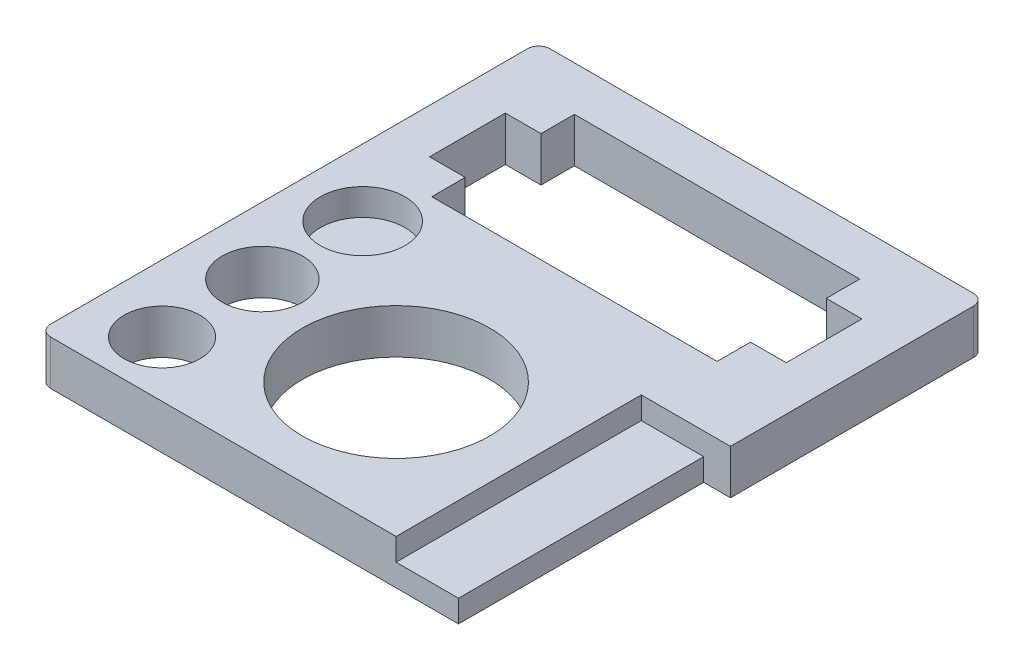
ISO-10303-21;
HEADER;
FILE_DESCRIPTION(('STEP AP214'),'2;1');
FILE_NAME('part.step','',(''),(''),'','','');
FILE_SCHEMA(('AUTOMOTIVE_DESIGN { 1 0 10303 214 1 1 1 1 }'));
ENDSEC;
DATA;
#1=APPLICATION_CONTEXT('core data for automotive mechanical design processes');
#2=APPLICATION_PROTOCOL_DEFINITION('international standard','automotive_design',2000,#1);
#3=PRODUCT_CONTEXT('',#1,'mechanical');
#4=PRODUCT('Part','Part','',(#3));
#5=PRODUCT_RELATED_PRODUCT_CATEGORY('part','',(#4));
#6=PRODUCT_DEFINITION_FORMATION('','',#4);
#7=PRODUCT_DEFINITION_CONTEXT('part definition',#1,'design');
#8=PRODUCT_DEFINITION('design','',#6,#7);
#9=PRODUCT_DEFINITION_SHAPE('','',#8);
#10=(LENGTH_UNIT() NAMED_UNIT(*) SI_UNIT(.MILLI.,.METRE.));
#11=(NAMED_UNIT(*) PLANE_ANGLE_UNIT() SI_UNIT($,.RADIAN.));
#12=(NAMED_UNIT(*) SI_UNIT($,.STERADIAN.) SOLID_ANGLE_UNIT());
#13=UNCERTAINTY_MEASURE_WITH_UNIT(LENGTH_MEASURE(1.E-05),#10,'distance_accuracy_value','');
#14=(GEOMETRIC_REPRESENTATION_CONTEXT(3) GLOBAL_UNCERTAINTY_ASSIGNED_CONTEXT((#13)) GLOBAL_UNIT_ASSIGNED_CONTEXT((#10,
#11,#12)) REPRESENTATION_CONTEXT('',''));
#15=CARTESIAN_POINT('',(0.,0.,0.));
#16=DIRECTION('',(0.,0.,1.));
#17=DIRECTION('',(1.,0.,0.));
#18=AXIS2_PLACEMENT_3D('',#15,#16,#17);
#19=CARTESIAN_POINT('',(0.,2.,6.));
#20=DIRECTION('',(0.,0.,-1.));
#21=DIRECTION('',(-1.,0.,0.));
#22=AXIS2_PLACEMENT_3D('',#19,#20,#21);
#23=PLANE('',#22);
#24=DIRECTION('',(1.,0.,0.));
#25=VECTOR('',#24,1.);
#26=CARTESIAN_POINT('',(0.,2.,6.));
#27=LINE('',#26,#25);
#28=CARTESIAN_POINT('',(-9.5,2.,6.));
#29=VERTEX_POINT('',#28);
#30=CARTESIAN_POINT('',(6.,2.,6.));
#31=VERTEX_POINT('',#30);
#32=EDGE_CURVE('E351',#29,#31,#27,.T.);
#33=ORIENTED_EDGE('',*,*,#32,.F.);
#34=DIRECTION('',(0.,-1.,0.));
#35=VECTOR('',#34,1.);
#36=CARTESIAN_POINT('',(-9.5,2.,6.));
#37=LINE('',#36,#35);
#38=CARTESIAN_POINT('',(-9.5,0.,6.));
#39=VERTEX_POINT('',#38);
#40=EDGE_CURVE('E273',#29,#39,#37,.T.);
#41=ORIENTED_EDGE('',*,*,#40,.T.);
#42=DIRECTION('',(1.,0.,0.));
#43=VECTOR('',#42,1.);
#44=CARTESIAN_POINT('',(0.,0.,6.));
#45=LINE('',#44,#43);
#46=CARTESIAN_POINT('',(8.8,0.,6.));
#47=VERTEX_POINT('',#46);
#48=EDGE_CURVE('E298',#39,#47,#45,.T.);
#49=ORIENTED_EDGE('',*,*,#48,.T.);
#50=DIRECTION('',(0.,-1.,0.));
#51=VECTOR('',#50,1.);
#52=CARTESIAN_POINT('',(8.8,1.,6.));
#53=LINE('',#52,#51);
#54=CARTESIAN_POINT('',(8.8,1.,6.));
#55=VERTEX_POINT('',#54);
#56=EDGE_CURVE('E391',#55,#47,#53,.T.);
#57=ORIENTED_EDGE('',*,*,#56,.F.);
#58=DIRECTION('',(-1.,0.,0.));
#59=VECTOR('',#58,1.);
#60=CARTESIAN_POINT('',(6.,1.,6.));
#61=LINE('',#60,#59);
#62=CARTESIAN_POINT('',(6.,1.,6.));
#63=VERTEX_POINT('',#62);
#64=EDGE_CURVE('E396',#55,#63,#61,.T.);
#65=ORIENTED_EDGE('',*,*,#64,.T.);
#66=DIRECTION('',(0.,-1.,0.));
#67=VECTOR('',#66,1.);
#68=CARTESIAN_POINT('',(6.,2.,6.));
#69=LINE('',#68,#67);
#70=EDGE_CURVE('E213',#31,#63,#69,.T.);
#71=ORIENTED_EDGE('',*,*,#70,.F.);
#72=EDGE_LOOP('',(#33,#41,#49,#57,#65,#71));
#73=FACE_BOUND('',#72,.T.);
#74=ADVANCED_FACE('F38',(#73),#23,.F.);
#75=CARTESIAN_POINT('',(6.,2.,0.));
#76=DIRECTION('',(-1.,0.,0.));
#77=DIRECTION('',(0.,0.,1.));
#78=AXIS2_PLACEMENT_3D('',#75,#76,#77);
#79=PLANE('',#78);
#80=ORIENTED_EDGE('',*,*,#70,.T.);
#81=DIRECTION('',(0.,0.,-1.));
#82=VECTOR('',#81,1.);
#83=CARTESIAN_POINT('',(6.,1.,-5.));
#84=LINE('',#83,#82);
#85=CARTESIAN_POINT('',(6.,1.,-5.));
#86=VERTEX_POINT('',#85);
#87=EDGE_CURVE('E197',#63,#86,#84,.T.);
#88=ORIENTED_EDGE('',*,*,#87,.T.);
#89=DIRECTION('',(0.,-1.,0.));
#90=VECTOR('',#89,1.);
#91=CARTESIAN_POINT('',(6.,2.,-5.));
#92=LINE('',#91,#90);
#93=CARTESIAN_POINT('',(6.,2.,-5.));
#94=VERTEX_POINT('',#93);
#95=EDGE_CURVE('E210',#94,#86,#92,.T.);
#96=ORIENTED_EDGE('',*,*,#95,.F.);
#97=DIRECTION('',(0.,0.,-1.));
#98=VECTOR('',#97,1.);
#99=CARTESIAN_POINT('',(6.,2.,0.));
#100=LINE('',#99,#98);
#101=EDGE_CURVE('E349',#31,#94,#100,.T.);
#102=ORIENTED_EDGE('',*,*,#101,.F.);
#103=EDGE_LOOP('',(#80,#88,#96,#102));
#104=FACE_BOUND('',#103,.T.);
#105=ADVANCED_FACE('F208',(#104),#79,.F.);
#106=CARTESIAN_POINT('',(0.,2.,-5.));
#107=DIRECTION('',(0.,0.,1.));
#108=DIRECTION('',(1.,0.,0.));
#109=AXIS2_PLACEMENT_3D('',#106,#107,#108);
#110=PLANE('',#109);
#111=DIRECTION('',(0.,-1.,0.));
#112=VECTOR('',#111,1.);
#113=CARTESIAN_POINT('',(8.8,1.,-5.));
#114=LINE('',#113,#112);
#115=CARTESIAN_POINT('',(8.8,1.,-5.));
#116=VERTEX_POINT('',#115);
#117=CARTESIAN_POINT('',(8.8,0.,-5.));
#118=VERTEX_POINT('',#117);
#119=EDGE_CURVE('E394',#116,#118,#114,.T.);
#120=ORIENTED_EDGE('',*,*,#119,.T.);
#121=DIRECTION('',(-1.,0.,0.));
#122=VECTOR('',#121,1.);
#123=CARTESIAN_POINT('',(0.,0.,-5.));
#124=LINE('',#123,#122);
#125=CARTESIAN_POINT('',(10.,0.,-5.));
#126=VERTEX_POINT('',#125);
#127=EDGE_CURVE('E295',#126,#118,#124,.T.);
#128=ORIENTED_EDGE('',*,*,#127,.F.);
#129=DIRECTION('',(0.,-1.,0.));
#130=VECTOR('',#129,1.);
#131=CARTESIAN_POINT('',(10.,2.,-5.));
#132=LINE('',#131,#130);
#133=CARTESIAN_POINT('',(10.,2.,-5.));
#134=VERTEX_POINT('',#133);
#135=EDGE_CURVE('E220',#134,#126,#132,.T.);
#136=ORIENTED_EDGE('',*,*,#135,.F.);
#137=DIRECTION('',(-1.,0.,0.));
#138=VECTOR('',#137,1.);
#139=CARTESIAN_POINT('',(0.,2.,-5.));
#140=LINE('',#139,#138);
#141=EDGE_CURVE('E219',#134,#94,#140,.T.);
#142=ORIENTED_EDGE('',*,*,#141,.T.);
#143=ORIENTED_EDGE('',*,*,#95,.T.);
#144=DIRECTION('',(1.,0.,0.));
#145=VECTOR('',#144,1.);
#146=CARTESIAN_POINT('',(6.,1.,-5.));
#147=LINE('',#146,#145);
#148=EDGE_CURVE('E193',#86,#116,#147,.T.);
#149=ORIENTED_EDGE('',*,*,#148,.T.);
#150=EDGE_LOOP('',(#120,#128,#136,#142,#143,#149));
#151=FACE_BOUND('',#150,.T.);
#152=ADVANCED_FACE('F216',(#151),#110,.T.);
#153=CARTESIAN_POINT('',(10.,2.,0.));
#154=DIRECTION('',(1.,0.,0.));
#155=DIRECTION('',(0.,0.,-1.));
#156=AXIS2_PLACEMENT_3D('',#153,#154,#155);
#157=PLANE('',#156);
#158=DIRECTION('',(0.,0.,1.));
#159=VECTOR('',#158,1.);
#160=CARTESIAN_POINT('',(10.,0.,0.));
#161=LINE('',#160,#159);
#162=CARTESIAN_POINT('',(10.,0.,-15.9));
#163=VERTEX_POINT('',#162);
#164=EDGE_CURVE('E291',#163,#126,#161,.T.);
#165=ORIENTED_EDGE('',*,*,#164,.F.);
#166=DIRECTION('',(0.,-1.,0.));
#167=VECTOR('',#166,1.);
#168=CARTESIAN_POINT('',(10.,2.,-15.9));
#169=LINE('',#168,#167);
#170=CARTESIAN_POINT('',(10.,2.,-15.9));
#171=VERTEX_POINT('',#170);
#172=EDGE_CURVE('E266',#163,#171,#169,.F.);
#173=ORIENTED_EDGE('',*,*,#172,.T.);
#174=DIRECTION('',(0.,0.,1.));
#175=VECTOR('',#174,1.);
#176=CARTESIAN_POINT('',(10.,2.,0.));
#177=LINE('',#176,#175);
#178=EDGE_CURVE('E346',#171,#134,#177,.T.);
#179=ORIENTED_EDGE('',*,*,#178,.T.);
#180=ORIENTED_EDGE('',*,*,#135,.T.);
#181=EDGE_LOOP('',(#165,#173,#179,#180));
#182=FACE_BOUND('',#181,.T.);
#183=ADVANCED_FACE('F544',(#182),#157,.T.);
#184=CARTESIAN_POINT('',(0.,2.,-16.4));
#185=DIRECTION('',(0.,0.,-1.));
#186=DIRECTION('',(-1.,0.,0.));
#187=AXIS2_PLACEMENT_3D('',#184,#185,#186);
#188=PLANE('',#187);
#189=DIRECTION('',(1.,0.,0.));
#190=VECTOR('',#189,1.);
#191=CARTESIAN_POINT('',(0.,2.,-16.4));
#192=LINE('',#191,#190);
#193=CARTESIAN_POINT('',(-9.5,2.,-16.4));
#194=VERTEX_POINT('',#193);
#195=CARTESIAN_POINT('',(9.5,2.,-16.4));
#196=VERTEX_POINT('',#195);
#197=EDGE_CURVE('E343',#194,#196,#192,.T.);
#198=ORIENTED_EDGE('',*,*,#197,.T.);
#199=DIRECTION('',(0.,-1.,0.));
#200=VECTOR('',#199,1.);
#201=CARTESIAN_POINT('',(9.5,2.,-16.4));
#202=LINE('',#201,#200);
#203=CARTESIAN_POINT('',(9.5,0.,-16.4));
#204=VERTEX_POINT('',#203);
#205=EDGE_CURVE('E257',#196,#204,#202,.T.);
#206=ORIENTED_EDGE('',*,*,#205,.T.);
#207=DIRECTION('',(1.,0.,0.));
#208=VECTOR('',#207,1.);
#209=CARTESIAN_POINT('',(0.,0.,-16.4));
#210=LINE('',#209,#208);
#211=CARTESIAN_POINT('',(-9.5,0.,-16.4));
#212=VERTEX_POINT('',#211);
#213=EDGE_CURVE('E287',#212,#204,#210,.T.);
#214=ORIENTED_EDGE('',*,*,#213,.F.);
#215=DIRECTION('',(0.,-1.,0.));
#216=VECTOR('',#215,1.);
#217=CARTESIAN_POINT('',(-9.5,2.,-16.4));
#218=LINE('',#217,#216);
#219=EDGE_CURVE('E222',#212,#194,#218,.F.);
#220=ORIENTED_EDGE('',*,*,#219,.T.);
#221=EDGE_LOOP('',(#198,#206,#214,#220));
#222=FACE_BOUND('',#221,.T.);
#223=ADVANCED_FACE('F474',(#222),#188,.T.);
#224=CARTESIAN_POINT('',(0.,2.,-12.9));
#225=DIRECTION('',(0.,0.,1.));
#226=DIRECTION('',(1.,0.,0.));
#227=AXIS2_PLACEMENT_3D('',#224,#225,#226);
#228=PLANE('',#227);
#229=DIRECTION('',(-1.,0.,0.));
#230=VECTOR('',#229,1.);
#231=CARTESIAN_POINT('',(0.,0.,-12.9));
#232=LINE('',#231,#230);
#233=CARTESIAN_POINT('',(8.,0.,-12.9));
#234=VERTEX_POINT('',#233);
#235=CARTESIAN_POINT('',(6.4,0.,-12.9));
#236=VERTEX_POINT('',#235);
#237=EDGE_CURVE('E329',#234,#236,#232,.T.);
#238=ORIENTED_EDGE('',*,*,#237,.F.);
#239=DIRECTION('',(0.,-1.,0.));
#240=VECTOR('',#239,1.);
#241=CARTESIAN_POINT('',(8.,2.,-12.9));
#242=LINE('',#241,#240);
#243=CARTESIAN_POINT('',(8.,2.,-12.9));
#244=VERTEX_POINT('',#243);
#245=EDGE_CURVE('E225',#244,#234,#242,.T.);
#246=ORIENTED_EDGE('',*,*,#245,.F.);
#247=DIRECTION('',(-1.,0.,0.));
#248=VECTOR('',#247,1.);
#249=CARTESIAN_POINT('',(0.,2.,-12.9));
#250=LINE('',#249,#248);
#251=CARTESIAN_POINT('',(6.4,2.,-12.9));
#252=VERTEX_POINT('',#251);
#253=EDGE_CURVE('E380',#244,#252,#250,.T.);
#254=ORIENTED_EDGE('',*,*,#253,.T.);
#255=DIRECTION('',(0.,-1.,0.));
#256=VECTOR('',#255,1.);
#257=CARTESIAN_POINT('',(6.4,2.,-12.9));
#258=LINE('',#257,#256);
#259=EDGE_CURVE('E229',#252,#236,#258,.T.);
#260=ORIENTED_EDGE('',*,*,#259,.T.);
#261=EDGE_LOOP('',(#238,#246,#254,#260));
#262=FACE_BOUND('',#261,.T.);
#263=ADVANCED_FACE('F470',(#262),#228,.T.);
#264=CARTESIAN_POINT('',(8.00000000000001,2.,0.));
#265=DIRECTION('',(1.,0.,0.));
#266=DIRECTION('',(0.,0.,-1.));
#267=AXIS2_PLACEMENT_3D('',#264,#265,#266);
#268=PLANE('',#267);
#269=DIRECTION('',(0.,0.,1.));
#270=VECTOR('',#269,1.);
#271=CARTESIAN_POINT('',(8.00000000000001,0.,0.));
#272=LINE('',#271,#270);
#273=CARTESIAN_POINT('',(8.,0.,-9.50000000000001));
#274=VERTEX_POINT('',#273);
#275=EDGE_CURVE('E326',#234,#274,#272,.T.);
#276=ORIENTED_EDGE('',*,*,#275,.T.);
#277=DIRECTION('',(0.,-1.,0.));
#278=VECTOR('',#277,1.);
#279=CARTESIAN_POINT('',(8.,2.,-9.50000000000001));
#280=LINE('',#279,#278);
#281=CARTESIAN_POINT('',(8.,2.,-9.50000000000001));
#282=VERTEX_POINT('',#281);
#283=EDGE_CURVE('E252',#282,#274,#280,.T.);
#284=ORIENTED_EDGE('',*,*,#283,.F.);
#285=DIRECTION('',(0.,0.,1.));
#286=VECTOR('',#285,1.);
#287=CARTESIAN_POINT('',(8.00000000000001,2.,0.));
#288=LINE('',#287,#286);
#289=EDGE_CURVE('E377',#244,#282,#288,.T.);
#290=ORIENTED_EDGE('',*,*,#289,.F.);
#291=ORIENTED_EDGE('',*,*,#245,.T.);
#292=EDGE_LOOP('',(#276,#284,#290,#291));
#293=FACE_BOUND('',#292,.T.);
#294=ADVANCED_FACE('F466',(#293),#268,.F.);
#295=CARTESIAN_POINT('',(0.,2.,-9.5));
#296=DIRECTION('',(0.,0.,1.));
#297=DIRECTION('',(1.,0.,0.));
#298=AXIS2_PLACEMENT_3D('',#295,#296,#297);
#299=PLANE('',#298);
#300=DIRECTION('',(-1.,0.,0.));
#301=VECTOR('',#300,1.);
#302=CARTESIAN_POINT('',(0.,0.,-9.5));
#303=LINE('',#302,#301);
#304=CARTESIAN_POINT('',(6.4,0.,-9.5));
#305=VERTEX_POINT('',#304);
#306=EDGE_CURVE('E323',#274,#305,#303,.T.);
#307=ORIENTED_EDGE('',*,*,#306,.T.);
#308=DIRECTION('',(0.,-1.,0.));
#309=VECTOR('',#308,1.);
#310=CARTESIAN_POINT('',(6.4,2.,-9.5));
#311=LINE('',#310,#309);
#312=CARTESIAN_POINT('',(6.4,2.,-9.5));
#313=VERTEX_POINT('',#312);
#314=EDGE_CURVE('E249',#313,#305,#311,.T.);
#315=ORIENTED_EDGE('',*,*,#314,.F.);
#316=DIRECTION('',(-1.,0.,0.));
#317=VECTOR('',#316,1.);
#318=CARTESIAN_POINT('',(0.,2.,-9.5));
#319=LINE('',#318,#317);
#320=EDGE_CURVE('E374',#282,#313,#319,.T.);
#321=ORIENTED_EDGE('',*,*,#320,.F.);
#322=ORIENTED_EDGE('',*,*,#283,.T.);
#323=EDGE_LOOP('',(#307,#315,#321,#322));
#324=FACE_BOUND('',#323,.T.);
#325=ADVANCED_FACE('F463',(#324),#299,.F.);
#326=CARTESIAN_POINT('',(6.4,2.,0.));
#327=DIRECTION('',(1.,0.,0.));
#328=DIRECTION('',(0.,0.,-1.));
#329=AXIS2_PLACEMENT_3D('',#326,#327,#328);
#330=PLANE('',#329);
#331=DIRECTION('',(0.,0.,1.));
#332=VECTOR('',#331,1.);
#333=CARTESIAN_POINT('',(6.4,0.,0.));
#334=LINE('',#333,#332);
#335=CARTESIAN_POINT('',(6.4,0.,-8.00000000000001));
#336=VERTEX_POINT('',#335);
#337=EDGE_CURVE('E320',#305,#336,#334,.T.);
#338=ORIENTED_EDGE('',*,*,#337,.T.);
#339=DIRECTION('',(0.,-1.,0.));
#340=VECTOR('',#339,1.);
#341=CARTESIAN_POINT('',(6.4,2.,-8.00000000000001));
#342=LINE('',#341,#340);
#343=CARTESIAN_POINT('',(6.4,2.,-8.00000000000001));
#344=VERTEX_POINT('',#343);
#345=EDGE_CURVE('E247',#344,#336,#342,.T.);
#346=ORIENTED_EDGE('',*,*,#345,.F.);
#347=DIRECTION('',(0.,0.,1.));
#348=VECTOR('',#347,1.);
#349=CARTESIAN_POINT('',(6.4,2.,0.));
#350=LINE('',#349,#348);
#351=EDGE_CURVE('E372',#313,#344,#350,.T.);
#352=ORIENTED_EDGE('',*,*,#351,.F.);
#353=ORIENTED_EDGE('',*,*,#314,.T.);
#354=EDGE_LOOP('',(#338,#346,#352,#353));
#355=FACE_BOUND('',#354,.T.);
#356=ADVANCED_FACE('F438',(#355),#330,.F.);
#357=CARTESIAN_POINT('',(0.,2.,-8.));
#358=DIRECTION('',(0.,0.,-1.));
#359=DIRECTION('',(-1.,0.,0.));
#360=AXIS2_PLACEMENT_3D('',#357,#358,#359);
#361=PLANE('',#360);
#362=DIRECTION('',(1.,0.,0.));
#363=VECTOR('',#362,1.);
#364=CARTESIAN_POINT('',(0.,0.,-8.));
#365=LINE('',#364,#363);
#366=CARTESIAN_POINT('',(-6.4,0.,-8.));
#367=VERTEX_POINT('',#366);
#368=EDGE_CURVE('E317',#367,#336,#365,.T.);
#369=ORIENTED_EDGE('',*,*,#368,.F.);
#370=DIRECTION('',(0.,-1.,0.));
#371=VECTOR('',#370,1.);
#372=CARTESIAN_POINT('',(-6.4,2.,-8.));
#373=LINE('',#372,#371);
#374=CARTESIAN_POINT('',(-6.4,2.,-8.));
#375=VERTEX_POINT('',#374);
#376=EDGE_CURVE('E245',#375,#367,#373,.T.);
#377=ORIENTED_EDGE('',*,*,#376,.F.);
#378=DIRECTION('',(1.,0.,0.));
#379=VECTOR('',#378,1.);
#380=CARTESIAN_POINT('',(0.,2.,-8.));
#381=LINE('',#380,#379);
#382=EDGE_CURVE('E369',#375,#344,#381,.T.);
#383=ORIENTED_EDGE('',*,*,#382,.T.);
#384=ORIENTED_EDGE('',*,*,#345,.T.);
#385=EDGE_LOOP('',(#369,#377,#383,#384));
#386=FACE_BOUND('',#385,.T.);
#387=ADVANCED_FACE('F459',(#386),#361,.T.);
#388=CARTESIAN_POINT('',(-6.4,2.,0.));
#389=DIRECTION('',(1.,0.,0.));
#390=DIRECTION('',(0.,0.,-1.));
#391=AXIS2_PLACEMENT_3D('',#388,#389,#390);
#392=PLANE('',#391);
#393=DIRECTION('',(0.,0.,1.));
#394=VECTOR('',#393,1.);
#395=CARTESIAN_POINT('',(-6.4,0.,0.));
#396=LINE('',#395,#394);
#397=CARTESIAN_POINT('',(-6.4,0.,-9.5));
#398=VERTEX_POINT('',#397);
#399=EDGE_CURVE('E314',#398,#367,#396,.T.);
#400=ORIENTED_EDGE('',*,*,#399,.F.);
#401=DIRECTION('',(0.,-1.,0.));
#402=VECTOR('',#401,1.);
#403=CARTESIAN_POINT('',(-6.4,2.,-9.5));
#404=LINE('',#403,#402);
#405=CARTESIAN_POINT('',(-6.4,2.,-9.5));
#406=VERTEX_POINT('',#405);
#407=EDGE_CURVE('E243',#406,#398,#404,.T.);
#408=ORIENTED_EDGE('',*,*,#407,.F.);
#409=DIRECTION('',(0.,0.,1.));
#410=VECTOR('',#409,1.);
#411=CARTESIAN_POINT('',(-6.4,2.,0.));
#412=LINE('',#411,#410);
#413=EDGE_CURVE('E366',#406,#375,#412,.T.);
#414=ORIENTED_EDGE('',*,*,#413,.T.);
#415=ORIENTED_EDGE('',*,*,#376,.T.);
#416=EDGE_LOOP('',(#400,#408,#414,#415));
#417=FACE_BOUND('',#416,.T.);
#418=ADVANCED_FACE('F447',(#417),#392,.T.);
#419=CARTESIAN_POINT('',(0.,2.,-9.49999999999999));
#420=DIRECTION('',(0.,0.,-1.));
#421=DIRECTION('',(-1.,0.,0.));
#422=AXIS2_PLACEMENT_3D('',#419,#420,#421);
#423=PLANE('',#422);
#424=DIRECTION('',(1.,0.,0.));
#425=VECTOR('',#424,1.);
#426=CARTESIAN_POINT('',(0.,0.,-9.49999999999999));
#427=LINE('',#426,#425);
#428=CARTESIAN_POINT('',(-8.,0.,-9.5));
#429=VERTEX_POINT('',#428);
#430=EDGE_CURVE('E311',#429,#398,#427,.T.);
#431=ORIENTED_EDGE('',*,*,#430,.F.);
#432=DIRECTION('',(0.,-1.,0.));
#433=VECTOR('',#432,1.);
#434=CARTESIAN_POINT('',(-8.,2.,-9.5));
#435=LINE('',#434,#433);
#436=CARTESIAN_POINT('',(-8.,2.,-9.5));
#437=VERTEX_POINT('',#436);
#438=EDGE_CURVE('E241',#437,#429,#435,.T.);
#439=ORIENTED_EDGE('',*,*,#438,.F.);
#440=DIRECTION('',(1.,0.,0.));
#441=VECTOR('',#440,1.);
#442=CARTESIAN_POINT('',(0.,2.,-9.49999999999999));
#443=LINE('',#442,#441);
#444=EDGE_CURVE('E363',#437,#406,#443,.T.);
#445=ORIENTED_EDGE('',*,*,#444,.T.);
#446=ORIENTED_EDGE('',*,*,#407,.T.);
#447=EDGE_LOOP('',(#431,#439,#445,#446));
#448=FACE_BOUND('',#447,.T.);
#449=ADVANCED_FACE('F454',(#448),#423,.T.);
#450=CARTESIAN_POINT('',(-8.,2.,0.));
#451=DIRECTION('',(1.,0.,0.));
#452=DIRECTION('',(0.,0.,-1.));
#453=AXIS2_PLACEMENT_3D('',#450,#451,#452);
#454=PLANE('',#453);
#455=DIRECTION('',(0.,0.,1.));
#456=VECTOR('',#455,1.);
#457=CARTESIAN_POINT('',(-8.,0.,0.));
#458=LINE('',#457,#456);
#459=CARTESIAN_POINT('',(-8.,0.,-12.9));
#460=VERTEX_POINT('',#459);
#461=EDGE_CURVE('E308',#460,#429,#458,.T.);
#462=ORIENTED_EDGE('',*,*,#461,.F.);
#463=DIRECTION('',(0.,-1.,0.));
#464=VECTOR('',#463,1.);
#465=CARTESIAN_POINT('',(-8.,2.,-12.9));
#466=LINE('',#465,#464);
#467=CARTESIAN_POINT('',(-8.,2.,-12.9));
#468=VERTEX_POINT('',#467);
#469=EDGE_CURVE('E239',#468,#460,#466,.T.);
#470=ORIENTED_EDGE('',*,*,#469,.F.);
#471=DIRECTION('',(0.,0.,1.));
#472=VECTOR('',#471,1.);
#473=CARTESIAN_POINT('',(-8.,2.,0.));
#474=LINE('',#473,#472);
#475=EDGE_CURVE('E360',#468,#437,#474,.T.);
#476=ORIENTED_EDGE('',*,*,#475,.T.);
#477=ORIENTED_EDGE('',*,*,#438,.T.);
#478=EDGE_LOOP('',(#462,#470,#476,#477));
#479=FACE_BOUND('',#478,.T.);
#480=ADVANCED_FACE('F450',(#479),#454,.T.);
#481=CARTESIAN_POINT('',(0.,2.,-12.9));
#482=DIRECTION('',(0.,0.,-1.));
#483=DIRECTION('',(-1.,0.,0.));
#484=AXIS2_PLACEMENT_3D('',#481,#482,#483);
#485=PLANE('',#484);
#486=DIRECTION('',(1.,0.,0.));
#487=VECTOR('',#486,1.);
#488=CARTESIAN_POINT('',(0.,0.,-12.9));
#489=LINE('',#488,#487);
#490=CARTESIAN_POINT('',(-6.4,0.,-12.9));
#491=VERTEX_POINT('',#490);
#492=EDGE_CURVE('E305',#460,#491,#489,.T.);
#493=ORIENTED_EDGE('',*,*,#492,.T.);
#494=DIRECTION('',(0.,-1.,0.));
#495=VECTOR('',#494,1.);
#496=CARTESIAN_POINT('',(-6.4,2.,-12.9));
#497=LINE('',#496,#495);
#498=CARTESIAN_POINT('',(-6.4,2.,-12.9));
#499=VERTEX_POINT('',#498);
#500=EDGE_CURVE('E237',#499,#491,#497,.T.);
#501=ORIENTED_EDGE('',*,*,#500,.F.);
#502=DIRECTION('',(1.,0.,0.));
#503=VECTOR('',#502,1.);
#504=CARTESIAN_POINT('',(0.,2.,-12.9));
#505=LINE('',#504,#503);
#506=EDGE_CURVE('E358',#468,#499,#505,.T.);
#507=ORIENTED_EDGE('',*,*,#506,.F.);
#508=ORIENTED_EDGE('',*,*,#469,.T.);
#509=EDGE_LOOP('',(#493,#501,#507,#508));
#510=FACE_BOUND('',#509,.T.);
#511=ADVANCED_FACE('F445',(#510),#485,.F.);
#512=CARTESIAN_POINT('',(-6.4,0.,-14.4));
#513=VERTEX_POINT('',#512);
#514=EDGE_CURVE('E304',#513,#491,#396,.T.);
#515=ORIENTED_EDGE('',*,*,#514,.F.);
#516=DIRECTION('',(0.,-1.,0.));
#517=VECTOR('',#516,1.);
#518=CARTESIAN_POINT('',(-6.4,2.,-14.4));
#519=LINE('',#518,#517);
#520=CARTESIAN_POINT('',(-6.4,2.,-14.4));
#521=VERTEX_POINT('',#520);
#522=EDGE_CURVE('E235',#521,#513,#519,.T.);
#523=ORIENTED_EDGE('',*,*,#522,.F.);
#524=EDGE_CURVE('E357',#521,#499,#412,.T.);
#525=ORIENTED_EDGE('',*,*,#524,.T.);
#526=ORIENTED_EDGE('',*,*,#500,.T.);
#527=EDGE_LOOP('',(#515,#523,#525,#526));
#528=FACE_BOUND('',#527,.T.);
#529=ADVANCED_FACE('F441',(#528),#392,.T.);
#530=CARTESIAN_POINT('',(0.,2.,-14.4));
#531=DIRECTION('',(0.,0.,-1.));
#532=DIRECTION('',(-1.,0.,0.));
#533=AXIS2_PLACEMENT_3D('',#530,#531,#532);
#534=PLANE('',#533);
#535=DIRECTION('',(1.,0.,0.));
#536=VECTOR('',#535,1.);
#537=CARTESIAN_POINT('',(0.,0.,-14.4));
#538=LINE('',#537,#536);
#539=CARTESIAN_POINT('',(6.4,0.,-14.4));
#540=VERTEX_POINT('',#539);
#541=EDGE_CURVE('E301',#513,#540,#538,.T.);
#542=ORIENTED_EDGE('',*,*,#541,.T.);
#543=DIRECTION('',(0.,-1.,0.));
#544=VECTOR('',#543,1.);
#545=CARTESIAN_POINT('',(6.4,2.,-14.4));
#546=LINE('',#545,#544);
#547=CARTESIAN_POINT('',(6.4,2.,-14.4));
#548=VERTEX_POINT('',#547);
#549=EDGE_CURVE('E231',#548,#540,#546,.T.);
#550=ORIENTED_EDGE('',*,*,#549,.F.);
#551=DIRECTION('',(1.,0.,0.));
#552=VECTOR('',#551,1.);
#553=CARTESIAN_POINT('',(0.,2.,-14.4));
#554=LINE('',#553,#552);
#555=EDGE_CURVE('E354',#521,#548,#554,.T.);
#556=ORIENTED_EDGE('',*,*,#555,.F.);
#557=ORIENTED_EDGE('',*,*,#522,.T.);
#558=EDGE_LOOP('',(#542,#550,#556,#557));
#559=FACE_BOUND('',#558,.T.);
#560=ADVANCED_FACE('F436',(#559),#534,.F.);
#561=EDGE_CURVE('E300',#540,#236,#334,.T.);
#562=ORIENTED_EDGE('',*,*,#561,.T.);
#563=ORIENTED_EDGE('',*,*,#259,.F.);
#564=EDGE_CURVE('E353',#548,#252,#350,.T.);
#565=ORIENTED_EDGE('',*,*,#564,.F.);
#566=ORIENTED_EDGE('',*,*,#549,.T.);
#567=EDGE_LOOP('',(#562,#563,#565,#566));
#568=FACE_BOUND('',#567,.T.);
#569=ADVANCED_FACE('F432',(#568),#330,.F.);
#570=CARTESIAN_POINT('',(0.,2.,0.));
#571=DIRECTION('',(0.,-1.,0.));
#572=DIRECTION('',(0.,0.,-1.));
#573=AXIS2_PLACEMENT_3D('',#570,#571,#572);
#574=CYLINDRICAL_SURFACE('',#573,4.2);
#575=CARTESIAN_POINT('',(0.,2.,0.));
#576=DIRECTION('',(0.,1.,0.));
#577=DIRECTION('',(0.,0.,1.));
#578=AXIS2_PLACEMENT_3D('',#575,#576,#577);
#579=CIRCLE('',#578,4.2);
#580=CARTESIAN_POINT('',(0.,2.,4.2));
#581=VERTEX_POINT('',#580);
#582=EDGE_CURVE('E383',#581,#581,#579,.T.);
#583=ORIENTED_EDGE('',*,*,#582,.T.);
#584=EDGE_LOOP('',(#583));
#585=FACE_BOUND('',#584,.T.);
#586=CARTESIAN_POINT('',(0.,0.,0.));
#587=DIRECTION('',(0.,1.,0.));
#588=DIRECTION('',(0.,0.,1.));
#589=AXIS2_PLACEMENT_3D('',#586,#587,#588);
#590=CIRCLE('',#589,4.2);
#591=CARTESIAN_POINT('',(0.,0.,4.2));
#592=VERTEX_POINT('',#591);
#593=EDGE_CURVE('E332',#592,#592,#590,.T.);
#594=ORIENTED_EDGE('',*,*,#593,.F.);
#595=EDGE_LOOP('',(#594));
#596=FACE_BOUND('',#595,.T.);
#597=ADVANCED_FACE('F435',(#585,#596),#574,.F.);
#598=CARTESIAN_POINT('',(-7.,2.,3.5));
#599=DIRECTION('',(0.,-1.,0.));
#600=DIRECTION('',(0.,0.,-1.));
#601=AXIS2_PLACEMENT_3D('',#598,#599,#600);
#602=CYLINDRICAL_SURFACE('',#601,1.7);
#603=CARTESIAN_POINT('',(-7.,2.,3.5));
#604=DIRECTION('',(0.,1.,0.));
#605=DIRECTION('',(0.,0.,1.));
#606=AXIS2_PLACEMENT_3D('',#603,#604,#605);
#607=CIRCLE('',#606,1.7);
#608=CARTESIAN_POINT('',(-7.,2.,5.2));
#609=VERTEX_POINT('',#608);
#610=EDGE_CURVE('E289',#609,#609,#607,.T.);
#611=ORIENTED_EDGE('',*,*,#610,.T.);
#612=EDGE_LOOP('',(#611));
#613=FACE_BOUND('',#612,.T.);
#614=CARTESIAN_POINT('',(-7.,0.,3.5));
#615=DIRECTION('',(0.,1.,0.));
#616=DIRECTION('',(0.,0.,1.));
#617=AXIS2_PLACEMENT_3D('',#614,#615,#616);
#618=CIRCLE('',#617,1.7);
#619=CARTESIAN_POINT('',(-7.,0.,5.2));
#620=VERTEX_POINT('',#619);
#621=EDGE_CURVE('E335',#620,#620,#618,.T.);
#622=ORIENTED_EDGE('',*,*,#621,.F.);
#623=EDGE_LOOP('',(#622));
#624=FACE_BOUND('',#623,.T.);
#625=ADVANCED_FACE('F478',(#613,#624),#602,.F.);
#626=CARTESIAN_POINT('',(-7.,2.,-1.));
#627=DIRECTION('',(0.,-1.,0.));
#628=DIRECTION('',(0.,0.,-1.));
#629=AXIS2_PLACEMENT_3D('',#626,#627,#628);
#630=CYLINDRICAL_SURFACE('',#629,1.8);
#631=CARTESIAN_POINT('',(-7.,2.,-1.));
#632=DIRECTION('',(0.,1.,0.));
#633=DIRECTION('',(0.,0.,1.));
#634=AXIS2_PLACEMENT_3D('',#631,#632,#633);
#635=CIRCLE('',#634,1.8);
#636=CARTESIAN_POINT('',(-7.,2.,0.800000000000001));
#637=VERTEX_POINT('',#636);
#638=EDGE_CURVE('E286',#637,#637,#635,.T.);
#639=ORIENTED_EDGE('',*,*,#638,.T.);
#640=EDGE_LOOP('',(#639));
#641=FACE_BOUND('',#640,.T.);
#642=CARTESIAN_POINT('',(-7.,0.,-1.));
#643=DIRECTION('',(0.,1.,0.));
#644=DIRECTION('',(0.,0.,1.));
#645=AXIS2_PLACEMENT_3D('',#642,#643,#644);
#646=CIRCLE('',#645,1.8);
#647=CARTESIAN_POINT('',(-7.,0.,0.800000000000001));
#648=VERTEX_POINT('',#647);
#649=EDGE_CURVE('E338',#648,#648,#646,.T.);
#650=ORIENTED_EDGE('',*,*,#649,.F.);
#651=EDGE_LOOP('',(#650));
#652=FACE_BOUND('',#651,.T.);
#653=ADVANCED_FACE('F482',(#641,#652),#630,.F.);
#654=CARTESIAN_POINT('',(-10.,2.,0.));
#655=DIRECTION('',(1.,0.,0.));
#656=DIRECTION('',(0.,0.,-1.));
#657=AXIS2_PLACEMENT_3D('',#654,#655,#656);
#658=PLANE('',#657);
#659=DIRECTION('',(0.,0.,1.));
#660=VECTOR('',#659,1.);
#661=CARTESIAN_POINT('',(-10.,0.,0.));
#662=LINE('',#661,#660);
#663=CARTESIAN_POINT('',(-10.,0.,-15.9));
#664=VERTEX_POINT('',#663);
#665=CARTESIAN_POINT('',(-10.,0.,5.5));
#666=VERTEX_POINT('',#665);
#667=EDGE_CURVE('E279',#664,#666,#662,.T.);
#668=ORIENTED_EDGE('',*,*,#667,.T.);
#669=DIRECTION('',(0.,-1.,0.));
#670=VECTOR('',#669,1.);
#671=CARTESIAN_POINT('',(-10.,2.,5.5));
#672=LINE('',#671,#670);
#673=CARTESIAN_POINT('',(-10.,2.,5.5));
#674=VERTEX_POINT('',#673);
#675=EDGE_CURVE('E11',#666,#674,#672,.F.);
#676=ORIENTED_EDGE('',*,*,#675,.T.);
#677=DIRECTION('',(0.,0.,1.));
#678=VECTOR('',#677,1.);
#679=CARTESIAN_POINT('',(-10.,2.,0.));
#680=LINE('',#679,#678);
#681=CARTESIAN_POINT('',(-10.,2.,-15.9));
#682=VERTEX_POINT('',#681);
#683=EDGE_CURVE('E232',#682,#674,#680,.T.);
#684=ORIENTED_EDGE('',*,*,#683,.F.);
#685=DIRECTION('',(0.,-1.,0.));
#686=VECTOR('',#685,1.);
#687=CARTESIAN_POINT('',(-10.,0.,-15.9));
#688=LINE('',#687,#686);
#689=EDGE_CURVE('E46',#682,#664,#688,.T.);
#690=ORIENTED_EDGE('',*,*,#689,.T.);
#691=EDGE_LOOP('',(#668,#676,#684,#690));
#692=FACE_BOUND('',#691,.T.);
#693=ADVANCED_FACE('F278',(#692),#658,.F.);
#694=CARTESIAN_POINT('',(0.,2.,0.));
#695=DIRECTION('',(0.,1.,0.));
#696=DIRECTION('',(0.,0.,1.));
#697=AXIS2_PLACEMENT_3D('',#694,#695,#696);
#698=PLANE('',#697);
#699=CARTESIAN_POINT('',(-7.,2.,-5.5));
#700=DIRECTION('',(0.,1.,0.));
#701=DIRECTION('',(0.,0.,1.));
#702=AXIS2_PLACEMENT_3D('',#699,#700,#701);
#703=CIRCLE('',#702,1.9);
#704=CARTESIAN_POINT('',(-7.,2.,-3.6));
#705=VERTEX_POINT('',#704);
#706=EDGE_CURVE('E388',#705,#705,#703,.T.);
#707=ORIENTED_EDGE('',*,*,#706,.F.);
#708=EDGE_LOOP('',(#707));
#709=FACE_BOUND('',#708,.T.);
#710=ORIENTED_EDGE('',*,*,#638,.F.);
#711=EDGE_LOOP('',(#710));
#712=FACE_BOUND('',#711,.T.);
#713=ORIENTED_EDGE('',*,*,#610,.F.);
#714=EDGE_LOOP('',(#713));
#715=FACE_BOUND('',#714,.T.);
#716=ORIENTED_EDGE('',*,*,#582,.F.);
#717=EDGE_LOOP('',(#716));
#718=FACE_BOUND('',#717,.T.);
#719=ORIENTED_EDGE('',*,*,#253,.F.);
#720=ORIENTED_EDGE('',*,*,#289,.T.);
#721=ORIENTED_EDGE('',*,*,#320,.T.);
#722=ORIENTED_EDGE('',*,*,#351,.T.);
#723=ORIENTED_EDGE('',*,*,#382,.F.);
#724=ORIENTED_EDGE('',*,*,#413,.F.);
#725=ORIENTED_EDGE('',*,*,#444,.F.);
#726=ORIENTED_EDGE('',*,*,#475,.F.);
#727=ORIENTED_EDGE('',*,*,#506,.T.);
#728=ORIENTED_EDGE('',*,*,#524,.F.);
#729=ORIENTED_EDGE('',*,*,#555,.T.);
#730=ORIENTED_EDGE('',*,*,#564,.T.);
#731=EDGE_LOOP('',(#719,#720,#721,#722,#723,#724,#725,#726,#727,#728,#729,#730));
#732=FACE_BOUND('',#731,.T.);
#733=ORIENTED_EDGE('',*,*,#178,.F.);
#734=CARTESIAN_POINT('',(9.5,2.,-15.9));
#735=DIRECTION('',(0.,1.,0.));
#736=DIRECTION('',(0.,0.,1.));
#737=AXIS2_PLACEMENT_3D('',#734,#735,#736);
#738=CIRCLE('',#737,0.5);
#739=EDGE_CURVE('E271',#171,#196,#738,.T.);
#740=ORIENTED_EDGE('',*,*,#739,.T.);
#741=ORIENTED_EDGE('',*,*,#197,.F.);
#742=CARTESIAN_POINT('',(-9.5,2.,-15.9));
#743=DIRECTION('',(0.,1.,0.));
#744=DIRECTION('',(0.,0.,1.));
#745=AXIS2_PLACEMENT_3D('',#742,#743,#744);
#746=CIRCLE('',#745,0.5);
#747=EDGE_CURVE('E58',#194,#682,#746,.T.);
#748=ORIENTED_EDGE('',*,*,#747,.T.);
#749=ORIENTED_EDGE('',*,*,#683,.T.);
#750=CARTESIAN_POINT('',(-9.5,2.,5.5));
#751=DIRECTION('',(0.,1.,0.));
#752=DIRECTION('',(0.,0.,1.));
#753=AXIS2_PLACEMENT_3D('',#750,#751,#752);
#754=CIRCLE('',#753,0.5);
#755=EDGE_CURVE('E269',#674,#29,#754,.T.);
#756=ORIENTED_EDGE('',*,*,#755,.T.);
#757=ORIENTED_EDGE('',*,*,#32,.T.);
#758=ORIENTED_EDGE('',*,*,#101,.T.);
#759=ORIENTED_EDGE('',*,*,#141,.F.);
#760=EDGE_LOOP('',(#733,#740,#741,#748,#749,#756,#757,#758,#759));
#761=FACE_BOUND('',#760,.T.);
#762=ADVANCED_FACE('F411',(#709,#712,#715,#718,#732,#761),#698,.T.);
#763=CARTESIAN_POINT('',(0.,0.,0.));
#764=DIRECTION('',(0.,1.,0.));
#765=DIRECTION('',(0.,0.,1.));
#766=AXIS2_PLACEMENT_3D('',#763,#764,#765);
#767=PLANE('',#766);
#768=ORIENTED_EDGE('',*,*,#649,.T.);
#769=EDGE_LOOP('',(#768));
#770=FACE_BOUND('',#769,.T.);
#771=ORIENTED_EDGE('',*,*,#621,.T.);
#772=EDGE_LOOP('',(#771));
#773=FACE_BOUND('',#772,.T.);
#774=ORIENTED_EDGE('',*,*,#593,.T.);
#775=EDGE_LOOP('',(#774));
#776=FACE_BOUND('',#775,.T.);
#777=ORIENTED_EDGE('',*,*,#237,.T.);
#778=ORIENTED_EDGE('',*,*,#561,.F.);
#779=ORIENTED_EDGE('',*,*,#541,.F.);
#780=ORIENTED_EDGE('',*,*,#514,.T.);
#781=ORIENTED_EDGE('',*,*,#492,.F.);
#782=ORIENTED_EDGE('',*,*,#461,.T.);
#783=ORIENTED_EDGE('',*,*,#430,.T.);
#784=ORIENTED_EDGE('',*,*,#399,.T.);
#785=ORIENTED_EDGE('',*,*,#368,.T.);
#786=ORIENTED_EDGE('',*,*,#337,.F.);
#787=ORIENTED_EDGE('',*,*,#306,.F.);
#788=ORIENTED_EDGE('',*,*,#275,.F.);
#789=EDGE_LOOP('',(#777,#778,#779,#780,#781,#782,#783,#784,#785,#786,#787,#788));
#790=FACE_BOUND('',#789,.T.);
#791=ORIENTED_EDGE('',*,*,#213,.T.);
#792=CARTESIAN_POINT('',(9.5,0.,-15.9));
#793=DIRECTION('',(0.,1.,0.));
#794=DIRECTION('',(0.,0.,1.));
#795=AXIS2_PLACEMENT_3D('',#792,#793,#794);
#796=CIRCLE('',#795,0.5);
#797=EDGE_CURVE('E264',#204,#163,#796,.F.);
#798=ORIENTED_EDGE('',*,*,#797,.T.);
#799=ORIENTED_EDGE('',*,*,#164,.T.);
#800=ORIENTED_EDGE('',*,*,#127,.T.);
#801=DIRECTION('',(0.,0.,1.));
#802=VECTOR('',#801,1.);
#803=CARTESIAN_POINT('',(8.8,0.,-5.));
#804=LINE('',#803,#802);
#805=EDGE_CURVE('E214',#118,#47,#804,.T.);
#806=ORIENTED_EDGE('',*,*,#805,.T.);
#807=ORIENTED_EDGE('',*,*,#48,.F.);
#808=CARTESIAN_POINT('',(-9.5,0.,5.5));
#809=DIRECTION('',(0.,1.,0.));
#810=DIRECTION('',(0.,0.,1.));
#811=AXIS2_PLACEMENT_3D('',#808,#809,#810);
#812=CIRCLE('',#811,0.5);
#813=EDGE_CURVE('E262',#39,#666,#812,.F.);
#814=ORIENTED_EDGE('',*,*,#813,.T.);
#815=ORIENTED_EDGE('',*,*,#667,.F.);
#816=CARTESIAN_POINT('',(-9.5,0.,-15.9));
#817=DIRECTION('',(0.,1.,0.));
#818=DIRECTION('',(0.,0.,1.));
#819=AXIS2_PLACEMENT_3D('',#816,#817,#818);
#820=CIRCLE('',#819,0.5);
#821=EDGE_CURVE('E260',#664,#212,#820,.F.);
#822=ORIENTED_EDGE('',*,*,#821,.T.);
#823=EDGE_LOOP('',(#791,#798,#799,#800,#806,#807,#814,#815,#822));
#824=FACE_BOUND('',#823,.T.);
#825=ADVANCED_FACE('F283',(#770,#773,#776,#790,#824),#767,.F.);
#826=CARTESIAN_POINT('',(-7.,0.8,-5.5));
#827=DIRECTION('',(0.,1.,0.));
#828=DIRECTION('',(0.,0.,1.));
#829=AXIS2_PLACEMENT_3D('',#826,#827,#828);
#830=CYLINDRICAL_SURFACE('',#829,1.9);
#831=CARTESIAN_POINT('',(-7.,0.8,-5.5));
#832=DIRECTION('',(0.,1.,0.));
#833=DIRECTION('',(0.,0.,1.));
#834=AXIS2_PLACEMENT_3D('',#831,#832,#833);
#835=CIRCLE('',#834,1.9);
#836=CARTESIAN_POINT('',(-7.,0.8,-3.6));
#837=VERTEX_POINT('',#836);
#838=EDGE_CURVE('E341',#837,#837,#835,.T.);
#839=ORIENTED_EDGE('',*,*,#838,.F.);
#840=EDGE_LOOP('',(#839));
#841=FACE_BOUND('',#840,.T.);
#842=ORIENTED_EDGE('',*,*,#706,.T.);
#843=EDGE_LOOP('',(#842));
#844=FACE_BOUND('',#843,.T.);
#845=ADVANCED_FACE('F496',(#841,#844),#830,.F.);
#846=CARTESIAN_POINT('',(-7.,0.8,-5.5));
#847=DIRECTION('',(0.,1.,0.));
#848=DIRECTION('',(0.,0.,1.));
#849=AXIS2_PLACEMENT_3D('',#846,#847,#848);
#850=PLANE('',#849);
#851=ORIENTED_EDGE('',*,*,#838,.T.);
#852=EDGE_LOOP('',(#851));
#853=FACE_BOUND('',#852,.T.);
#854=ADVANCED_FACE('F634',(#853),#850,.T.);
#855=CARTESIAN_POINT('',(8.8,1.,-5.));
#856=DIRECTION('',(1.,0.,0.));
#857=DIRECTION('',(0.,0.,-1.));
#858=AXIS2_PLACEMENT_3D('',#855,#856,#857);
#859=PLANE('',#858);
#860=ORIENTED_EDGE('',*,*,#805,.F.);
#861=ORIENTED_EDGE('',*,*,#119,.F.);
#862=DIRECTION('',(0.,0.,1.));
#863=VECTOR('',#862,1.);
#864=CARTESIAN_POINT('',(8.8,1.,-5.));
#865=LINE('',#864,#863);
#866=EDGE_CURVE('E200',#116,#55,#865,.T.);
#867=ORIENTED_EDGE('',*,*,#866,.T.);
#868=ORIENTED_EDGE('',*,*,#56,.T.);
#869=EDGE_LOOP('',(#860,#861,#867,#868));
#870=FACE_BOUND('',#869,.T.);
#871=ADVANCED_FACE('F403',(#870),#859,.T.);
#872=CARTESIAN_POINT('',(0.,1.,0.));
#873=DIRECTION('',(0.,1.,0.));
#874=DIRECTION('',(0.,0.,1.));
#875=AXIS2_PLACEMENT_3D('',#872,#873,#874);
#876=PLANE('',#875);
#877=ORIENTED_EDGE('',*,*,#87,.F.);
#878=ORIENTED_EDGE('',*,*,#64,.F.);
#879=ORIENTED_EDGE('',*,*,#866,.F.);
#880=ORIENTED_EDGE('',*,*,#148,.F.);
#881=EDGE_LOOP('',(#877,#878,#879,#880));
#882=FACE_BOUND('',#881,.T.);
#883=ADVANCED_FACE('F195',(#882),#876,.T.);
#884=CARTESIAN_POINT('',(9.5,2.,-15.9));
#885=DIRECTION('',(0.,-1.,0.));
#886=DIRECTION('',(0.,0.,-1.));
#887=AXIS2_PLACEMENT_3D('',#884,#885,#886);
#888=CYLINDRICAL_SURFACE('',#887,0.5);
#889=ORIENTED_EDGE('',*,*,#739,.F.);
#890=ORIENTED_EDGE('',*,*,#172,.F.);
#891=ORIENTED_EDGE('',*,*,#797,.F.);
#892=ORIENTED_EDGE('',*,*,#205,.F.);
#893=EDGE_LOOP('',(#889,#890,#891,#892));
#894=FACE_BOUND('',#893,.T.);
#895=ADVANCED_FACE('F417',(#894),#888,.T.);
#896=CARTESIAN_POINT('',(-9.5,2.,5.5));
#897=DIRECTION('',(0.,-1.,0.));
#898=DIRECTION('',(0.,0.,-1.));
#899=AXIS2_PLACEMENT_3D('',#896,#897,#898);
#900=CYLINDRICAL_SURFACE('',#899,0.5);
#901=ORIENTED_EDGE('',*,*,#755,.F.);
#902=ORIENTED_EDGE('',*,*,#675,.F.);
#903=ORIENTED_EDGE('',*,*,#813,.F.);
#904=ORIENTED_EDGE('',*,*,#40,.F.);
#905=EDGE_LOOP('',(#901,#902,#903,#904));
#906=FACE_BOUND('',#905,.T.);
#907=ADVANCED_FACE('F415',(#906),#900,.T.);
#908=CARTESIAN_POINT('',(-9.5,2.,-15.9));
#909=DIRECTION('',(0.,1.,0.));
#910=DIRECTION('',(0.,0.,1.));
#911=AXIS2_PLACEMENT_3D('',#908,#909,#910);
#912=CYLINDRICAL_SURFACE('',#911,0.5);
#913=ORIENTED_EDGE('',*,*,#747,.F.);
#914=ORIENTED_EDGE('',*,*,#219,.F.);
#915=ORIENTED_EDGE('',*,*,#821,.F.);
#916=ORIENTED_EDGE('',*,*,#689,.F.);
#917=EDGE_LOOP('',(#913,#914,#915,#916));
#918=FACE_BOUND('',#917,.T.);
#919=ADVANCED_FACE('F40',(#918),#912,.T.);
#920=CLOSED_SHELL('',(#74,#105,#152,#183,#223,#263,#294,#325,#356,#387,#418,#449,#480,#511,#529,
#560,#569,#597,#625,#653,#693,#762,#825,#845,#854,#871,#883,#895,#907,#919));
#921=MANIFOLD_SOLID_BREP('B2',#920);
#922=ADVANCED_BREP_SHAPE_REPRESENTATION('',(#18,#921),#14);
#923=SHAPE_DEFINITION_REPRESENTATION(#9,#922);
ENDSEC;
END-ISO-10303-21;
